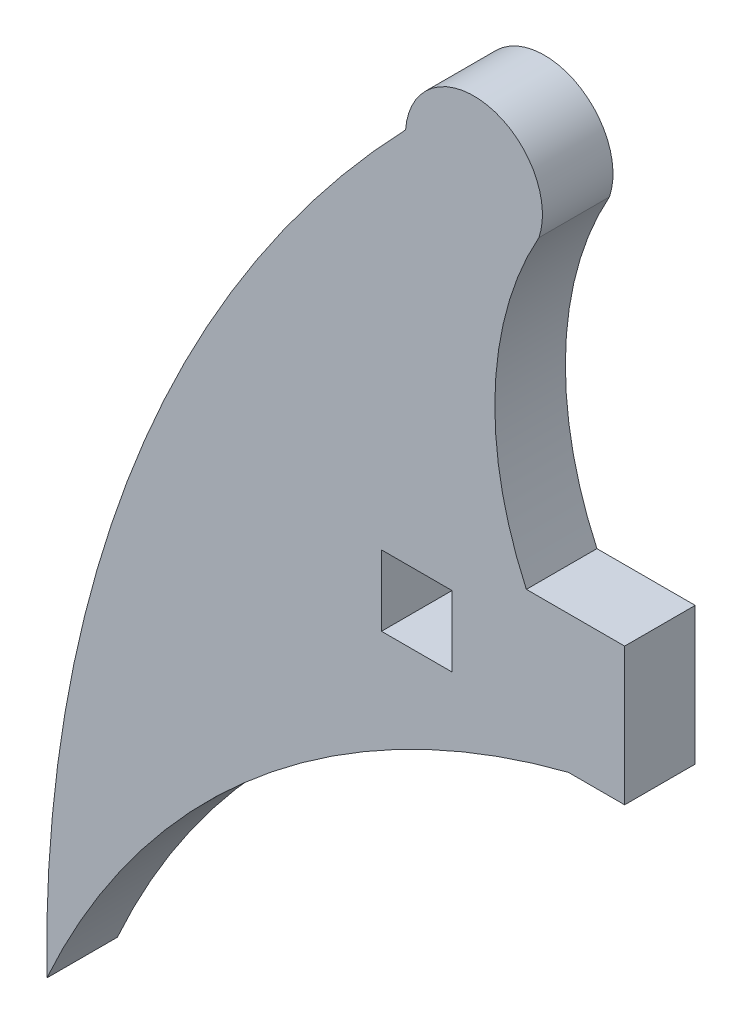
ISO-10303-21;
HEADER;
FILE_DESCRIPTION(('STEP AP214'),'2;1');
FILE_NAME('part.step','',(''),(''),'','','');
FILE_SCHEMA(('AUTOMOTIVE_DESIGN { 1 0 10303 214 1 1 1 1 }'));
ENDSEC;
DATA;
#1=APPLICATION_CONTEXT('core data for automotive mechanical design processes');
#2=APPLICATION_PROTOCOL_DEFINITION('international standard','automotive_design',2000,#1);
#3=PRODUCT_CONTEXT('',#1,'mechanical');
#4=PRODUCT('Part','Part','',(#3));
#5=PRODUCT_RELATED_PRODUCT_CATEGORY('part','',(#4));
#6=PRODUCT_DEFINITION_FORMATION('','',#4);
#7=PRODUCT_DEFINITION_CONTEXT('part definition',#1,'design');
#8=PRODUCT_DEFINITION('design','',#6,#7);
#9=PRODUCT_DEFINITION_SHAPE('','',#8);
#10=(LENGTH_UNIT() NAMED_UNIT(*) SI_UNIT(.MILLI.,.METRE.));
#11=(NAMED_UNIT(*) PLANE_ANGLE_UNIT() SI_UNIT($,.RADIAN.));
#12=(NAMED_UNIT(*) SI_UNIT($,.STERADIAN.) SOLID_ANGLE_UNIT());
#13=UNCERTAINTY_MEASURE_WITH_UNIT(LENGTH_MEASURE(1.E-05),#10,'distance_accuracy_value','');
#14=(GEOMETRIC_REPRESENTATION_CONTEXT(3) GLOBAL_UNCERTAINTY_ASSIGNED_CONTEXT((#13)) GLOBAL_UNIT_ASSIGNED_CONTEXT((#10,
#11,#12)) REPRESENTATION_CONTEXT('',''));
#15=CARTESIAN_POINT('',(0.,0.,0.));
#16=DIRECTION('',(0.,0.,1.));
#17=DIRECTION('',(1.,0.,0.));
#18=AXIS2_PLACEMENT_3D('',#15,#16,#17);
#19=CARTESIAN_POINT('',(-19.266087906411,-18.543187160067,1.524));
#20=DIRECTION('',(0.,0.,1.));
#21=DIRECTION('',(1.,0.,0.));
#22=AXIS2_PLACEMENT_3D('',#19,#20,#21);
#23=PLANE('',#22);
#24=DIRECTION('',(0.,1.,0.));
#25=VECTOR('',#24,1.);
#26=CARTESIAN_POINT('',(-22.225726205393,0.825499999999996,1.524));
#27=LINE('',#26,#25);
#28=CARTESIAN_POINT('',(-22.225726205393,-2.14505283981024,1.524));
#29=VERTEX_POINT('',#28);
#30=CARTESIAN_POINT('',(-22.225726205393,0.825499999999996,1.524));
#31=VERTEX_POINT('',#30);
#32=EDGE_CURVE('E151',#29,#31,#27,.T.);
#33=ORIENTED_EDGE('',*,*,#32,.T.);
#34=DIRECTION('',(-1.,0.,0.));
#35=VECTOR('',#34,1.);
#36=CARTESIAN_POINT('',(-24.3487320911912,0.825499999999996,1.524));
#37=LINE('',#36,#35);
#38=CARTESIAN_POINT('',(-24.3487320911912,0.825499999999999,1.524));
#39=VERTEX_POINT('',#38);
#40=EDGE_CURVE('E154',#31,#39,#37,.T.);
#41=ORIENTED_EDGE('',*,*,#40,.T.);
#42=CARTESIAN_POINT('',(-17.6689482784493,3.91993582217414,1.524));
#43=DIRECTION('',(0.,0.,-1.));
#44=DIRECTION('',(1.,0.,0.));
#45=AXIS2_PLACEMENT_3D('',#42,#43,#44);
#46=CIRCLE('',#45,7.36172838690231);
#47=CARTESIAN_POINT('',(-24.0780338660228,7.54190583498225,1.524));
#48=VERTEX_POINT('',#47);
#49=EDGE_CURVE('E157',#39,#48,#46,.T.);
#50=ORIENTED_EDGE('',*,*,#49,.T.);
#51=CARTESIAN_POINT('',(-25.4821370278551,8.01067786513667,1.524));
#52=DIRECTION('',(0.,0.,1.));
#53=DIRECTION('',(-1.,0.,0.));
#54=AXIS2_PLACEMENT_3D('',#51,#52,#53);
#55=CIRCLE('',#54,1.48028811564599);
#56=CARTESIAN_POINT('',(-26.958529188836,8.11800489955518,1.524));
#57=VERTEX_POINT('',#56);
#58=EDGE_CURVE('E159',#48,#57,#55,.T.);
#59=ORIENTED_EDGE('',*,*,#58,.T.);
#60=CARTESIAN_POINT('',(-6.89765811356134,-11.1510394794695,1.524));
#61=DIRECTION('',(0.,0.,1.));
#62=DIRECTION('',(-1.,0.,0.));
#63=AXIS2_PLACEMENT_3D('',#60,#61,#62);
#64=CIRCLE('',#63,27.8160856264791);
#65=CARTESIAN_POINT('',(-34.7096802394061,-11.6264812226261,1.524));
#66=VERTEX_POINT('',#65);
#67=EDGE_CURVE('E161',#57,#66,#64,.T.);
#68=ORIENTED_EDGE('',*,*,#67,.T.);
#69=CARTESIAN_POINT('',(-19.266087906411,-18.543187160067,1.524));
#70=DIRECTION('',(0.,0.,-1.));
#71=DIRECTION('',(1.,0.,0.));
#72=AXIS2_PLACEMENT_3D('',#69,#70,#71);
#73=CIRCLE('',#72,16.9217423799316);
#74=CARTESIAN_POINT('',(-23.4429953733764,-2.14505283981024,1.524));
#75=VERTEX_POINT('',#74);
#76=EDGE_CURVE('E163',#66,#75,#73,.T.);
#77=ORIENTED_EDGE('',*,*,#76,.T.);
#78=DIRECTION('',(1.,0.,0.));
#79=VECTOR('',#78,1.);
#80=CARTESIAN_POINT('',(-22.225726205393,-2.14505283981024,1.524));
#81=LINE('',#80,#79);
#82=EDGE_CURVE('E165',#75,#29,#81,.T.);
#83=ORIENTED_EDGE('',*,*,#82,.T.);
#84=EDGE_LOOP('',(#33,#41,#50,#59,#68,#77,#83));
#85=FACE_BOUND('',#84,.T.);
#86=DIRECTION('',(-1.,0.,0.));
#87=VECTOR('',#86,1.);
#88=CARTESIAN_POINT('',(-25.9548189252637,0.,1.524));
#89=LINE('',#88,#87);
#90=CARTESIAN_POINT('',(-25.9548189252637,0.,1.524));
#91=VERTEX_POINT('',#90);
#92=CARTESIAN_POINT('',(-27.4788189252637,0.,1.524));
#93=VERTEX_POINT('',#92);
#94=EDGE_CURVE('E123',#91,#93,#89,.T.);
#95=ORIENTED_EDGE('',*,*,#94,.F.);
#96=DIRECTION('',(0.,1.,0.));
#97=VECTOR('',#96,1.);
#98=CARTESIAN_POINT('',(-25.9548189252637,-1.524,1.524));
#99=LINE('',#98,#97);
#100=CARTESIAN_POINT('',(-25.9548189252637,-1.524,1.524));
#101=VERTEX_POINT('',#100);
#102=EDGE_CURVE('E115',#101,#91,#99,.T.);
#103=ORIENTED_EDGE('',*,*,#102,.F.);
#104=DIRECTION('',(1.,0.,0.));
#105=VECTOR('',#104,1.);
#106=CARTESIAN_POINT('',(-25.9548189252637,-1.524,1.524));
#107=LINE('',#106,#105);
#108=CARTESIAN_POINT('',(-27.4788189252637,-1.524,1.524));
#109=VERTEX_POINT('',#108);
#110=EDGE_CURVE('E137',#109,#101,#107,.T.);
#111=ORIENTED_EDGE('',*,*,#110,.F.);
#112=DIRECTION('',(0.,-1.,0.));
#113=VECTOR('',#112,1.);
#114=CARTESIAN_POINT('',(-27.4788189252637,-1.524,1.524));
#115=LINE('',#114,#113);
#116=EDGE_CURVE('E135',#93,#109,#115,.T.);
#117=ORIENTED_EDGE('',*,*,#116,.F.);
#118=EDGE_LOOP('',(#95,#103,#111,#117));
#119=FACE_BOUND('',#118,.T.);
#120=ADVANCED_FACE('F32',(#85,#119),#23,.T.);
#121=CARTESIAN_POINT('',(-19.266087906411,-18.543187160067,0.));
#122=DIRECTION('',(0.,0.,1.));
#123=DIRECTION('',(1.,0.,0.));
#124=AXIS2_PLACEMENT_3D('',#121,#122,#123);
#125=PLANE('',#124);
#126=DIRECTION('',(-1.,0.,0.));
#127=VECTOR('',#126,1.);
#128=CARTESIAN_POINT('',(-24.3487320911912,0.825499999999996,0.));
#129=LINE('',#128,#127);
#130=CARTESIAN_POINT('',(-22.225726205393,0.825499999999996,0.));
#131=VERTEX_POINT('',#130);
#132=CARTESIAN_POINT('',(-24.3487320911912,0.825499999999999,0.));
#133=VERTEX_POINT('',#132);
#134=EDGE_CURVE('E131',#131,#133,#129,.T.);
#135=ORIENTED_EDGE('',*,*,#134,.F.);
#136=DIRECTION('',(0.,1.,0.));
#137=VECTOR('',#136,1.);
#138=CARTESIAN_POINT('',(-22.225726205393,-1.524,0.));
#139=LINE('',#138,#137);
#140=CARTESIAN_POINT('',(-22.225726205393,-2.14505283981024,0.));
#141=VERTEX_POINT('',#140);
#142=EDGE_CURVE('E155',#141,#131,#139,.T.);
#143=ORIENTED_EDGE('',*,*,#142,.F.);
#144=DIRECTION('',(1.,0.,0.));
#145=VECTOR('',#144,1.);
#146=CARTESIAN_POINT('',(-22.225726205393,-2.14505283981024,0.));
#147=LINE('',#146,#145);
#148=CARTESIAN_POINT('',(-23.4429953733764,-2.14505283981024,0.));
#149=VERTEX_POINT('',#148);
#150=EDGE_CURVE('E178',#149,#141,#147,.T.);
#151=ORIENTED_EDGE('',*,*,#150,.F.);
#152=CARTESIAN_POINT('',(-19.266087906411,-18.543187160067,0.));
#153=DIRECTION('',(0.,0.,-1.));
#154=DIRECTION('',(1.,0.,0.));
#155=AXIS2_PLACEMENT_3D('',#152,#153,#154);
#156=CIRCLE('',#155,16.9217423799316);
#157=CARTESIAN_POINT('',(-34.7096802394061,-11.6264812226261,0.));
#158=VERTEX_POINT('',#157);
#159=EDGE_CURVE('E176',#158,#149,#156,.T.);
#160=ORIENTED_EDGE('',*,*,#159,.F.);
#161=CARTESIAN_POINT('',(-6.89765811356134,-11.1510394794695,0.));
#162=DIRECTION('',(0.,0.,1.));
#163=DIRECTION('',(-1.,0.,0.));
#164=AXIS2_PLACEMENT_3D('',#161,#162,#163);
#165=CIRCLE('',#164,27.8160856264791);
#166=CARTESIAN_POINT('',(-26.958529188836,8.11800489955518,0.));
#167=VERTEX_POINT('',#166);
#168=EDGE_CURVE('E174',#167,#158,#165,.T.);
#169=ORIENTED_EDGE('',*,*,#168,.F.);
#170=CARTESIAN_POINT('',(-25.4821370278551,8.01067786513667,0.));
#171=DIRECTION('',(0.,0.,1.));
#172=DIRECTION('',(-1.,0.,0.));
#173=AXIS2_PLACEMENT_3D('',#170,#171,#172);
#174=CIRCLE('',#173,1.48028811564599);
#175=CARTESIAN_POINT('',(-24.0780338660228,7.54190583498225,0.));
#176=VERTEX_POINT('',#175);
#177=EDGE_CURVE('E172',#176,#167,#174,.T.);
#178=ORIENTED_EDGE('',*,*,#177,.F.);
#179=CARTESIAN_POINT('',(-17.6689482784493,3.91993582217414,0.));
#180=DIRECTION('',(0.,0.,-1.));
#181=DIRECTION('',(1.,0.,0.));
#182=AXIS2_PLACEMENT_3D('',#179,#180,#181);
#183=CIRCLE('',#182,7.36172838690231);
#184=EDGE_CURVE('E170',#133,#176,#183,.T.);
#185=ORIENTED_EDGE('',*,*,#184,.F.);
#186=EDGE_LOOP('',(#135,#143,#151,#160,#169,#178,#185));
#187=FACE_BOUND('',#186,.T.);
#188=DIRECTION('',(0.,1.,0.));
#189=VECTOR('',#188,1.);
#190=CARTESIAN_POINT('',(-25.9548189252637,-1.524,0.));
#191=LINE('',#190,#189);
#192=CARTESIAN_POINT('',(-25.9548189252637,-1.524,0.));
#193=VERTEX_POINT('',#192);
#194=CARTESIAN_POINT('',(-25.9548189252637,0.,0.));
#195=VERTEX_POINT('',#194);
#196=EDGE_CURVE('E55',#193,#195,#191,.T.);
#197=ORIENTED_EDGE('',*,*,#196,.T.);
#198=DIRECTION('',(-1.,0.,0.));
#199=VECTOR('',#198,1.);
#200=CARTESIAN_POINT('',(-25.9548189252637,0.,0.));
#201=LINE('',#200,#199);
#202=CARTESIAN_POINT('',(-27.4788189252637,0.,0.));
#203=VERTEX_POINT('',#202);
#204=EDGE_CURVE('E130',#195,#203,#201,.T.);
#205=ORIENTED_EDGE('',*,*,#204,.T.);
#206=DIRECTION('',(0.,-1.,0.));
#207=VECTOR('',#206,1.);
#208=CARTESIAN_POINT('',(-27.4788189252637,-1.524,0.));
#209=LINE('',#208,#207);
#210=CARTESIAN_POINT('',(-27.4788189252637,-1.524,0.));
#211=VERTEX_POINT('',#210);
#212=EDGE_CURVE('E143',#203,#211,#209,.T.);
#213=ORIENTED_EDGE('',*,*,#212,.T.);
#214=DIRECTION('',(1.,0.,0.));
#215=VECTOR('',#214,1.);
#216=CARTESIAN_POINT('',(-25.9548189252637,-1.524,0.));
#217=LINE('',#216,#215);
#218=EDGE_CURVE('E124',#211,#193,#217,.T.);
#219=ORIENTED_EDGE('',*,*,#218,.T.);
#220=EDGE_LOOP('',(#197,#205,#213,#219));
#221=FACE_BOUND('',#220,.T.);
#222=ADVANCED_FACE('F205',(#187,#221),#125,.F.);
#223=CARTESIAN_POINT('',(-24.3487320911912,0.825499999999996,1.524));
#224=DIRECTION('',(0.,-1.,0.));
#225=DIRECTION('',(0.,0.,-1.));
#226=AXIS2_PLACEMENT_3D('',#223,#224,#225);
#227=PLANE('',#226);
#228=ORIENTED_EDGE('',*,*,#134,.T.);
#229=DIRECTION('',(0.,0.,-1.));
#230=VECTOR('',#229,1.);
#231=CARTESIAN_POINT('',(-24.3487320911912,0.825499999999999,1.524));
#232=LINE('',#231,#230);
#233=EDGE_CURVE('E40',#39,#133,#232,.T.);
#234=ORIENTED_EDGE('',*,*,#233,.F.);
#235=ORIENTED_EDGE('',*,*,#40,.F.);
#236=DIRECTION('',(0.,0.,-1.));
#237=VECTOR('',#236,1.);
#238=CARTESIAN_POINT('',(-22.225726205393,0.825499999999996,1.524));
#239=LINE('',#238,#237);
#240=EDGE_CURVE('E11',#31,#131,#239,.T.);
#241=ORIENTED_EDGE('',*,*,#240,.T.);
#242=EDGE_LOOP('',(#228,#234,#235,#241));
#243=FACE_BOUND('',#242,.T.);
#244=ADVANCED_FACE('F34',(#243),#227,.F.);
#245=CARTESIAN_POINT('',(-17.6689482784493,3.91993582217414,1.524));
#246=DIRECTION('',(0.,0.,-1.));
#247=DIRECTION('',(-1.,0.,0.));
#248=AXIS2_PLACEMENT_3D('',#245,#246,#247);
#249=CYLINDRICAL_SURFACE('',#248,7.36172838690231);
#250=ORIENTED_EDGE('',*,*,#184,.T.);
#251=DIRECTION('',(0.,0.,-1.));
#252=VECTOR('',#251,1.);
#253=CARTESIAN_POINT('',(-24.0780338660228,7.54190583498225,1.524));
#254=LINE('',#253,#252);
#255=EDGE_CURVE('E192',#48,#176,#254,.T.);
#256=ORIENTED_EDGE('',*,*,#255,.F.);
#257=ORIENTED_EDGE('',*,*,#49,.F.);
#258=ORIENTED_EDGE('',*,*,#233,.T.);
#259=EDGE_LOOP('',(#250,#256,#257,#258));
#260=FACE_BOUND('',#259,.T.);
#261=ADVANCED_FACE('F199',(#260),#249,.F.);
#262=CARTESIAN_POINT('',(-25.4821370278551,8.01067786513667,1.524));
#263=DIRECTION('',(0.,0.,-1.));
#264=DIRECTION('',(-1.,0.,0.));
#265=AXIS2_PLACEMENT_3D('',#262,#263,#264);
#266=CYLINDRICAL_SURFACE('',#265,1.48028811564599);
#267=ORIENTED_EDGE('',*,*,#177,.T.);
#268=DIRECTION('',(0.,0.,-1.));
#269=VECTOR('',#268,1.);
#270=CARTESIAN_POINT('',(-26.958529188836,8.11800489955518,1.524));
#271=LINE('',#270,#269);
#272=EDGE_CURVE('E189',#57,#167,#271,.T.);
#273=ORIENTED_EDGE('',*,*,#272,.F.);
#274=ORIENTED_EDGE('',*,*,#58,.F.);
#275=ORIENTED_EDGE('',*,*,#255,.T.);
#276=EDGE_LOOP('',(#267,#273,#274,#275));
#277=FACE_BOUND('',#276,.T.);
#278=ADVANCED_FACE('F212',(#277),#266,.T.);
#279=CARTESIAN_POINT('',(-6.89765811356134,-11.1510394794695,1.524));
#280=DIRECTION('',(0.,0.,-1.));
#281=DIRECTION('',(-1.,0.,0.));
#282=AXIS2_PLACEMENT_3D('',#279,#280,#281);
#283=CYLINDRICAL_SURFACE('',#282,27.8160856264791);
#284=ORIENTED_EDGE('',*,*,#168,.T.);
#285=DIRECTION('',(0.,0.,-1.));
#286=VECTOR('',#285,1.);
#287=CARTESIAN_POINT('',(-34.7096802394061,-11.6264812226261,1.524));
#288=LINE('',#287,#286);
#289=EDGE_CURVE('E186',#66,#158,#288,.T.);
#290=ORIENTED_EDGE('',*,*,#289,.F.);
#291=ORIENTED_EDGE('',*,*,#67,.F.);
#292=ORIENTED_EDGE('',*,*,#272,.T.);
#293=EDGE_LOOP('',(#284,#290,#291,#292));
#294=FACE_BOUND('',#293,.T.);
#295=ADVANCED_FACE('F216',(#294),#283,.T.);
#296=CARTESIAN_POINT('',(-19.266087906411,-18.543187160067,1.524));
#297=DIRECTION('',(0.,0.,-1.));
#298=DIRECTION('',(-1.,0.,0.));
#299=AXIS2_PLACEMENT_3D('',#296,#297,#298);
#300=CYLINDRICAL_SURFACE('',#299,16.9217423799316);
#301=ORIENTED_EDGE('',*,*,#159,.T.);
#302=DIRECTION('',(0.,0.,-1.));
#303=VECTOR('',#302,1.);
#304=CARTESIAN_POINT('',(-23.4429953733764,-2.14505283981024,1.524));
#305=LINE('',#304,#303);
#306=EDGE_CURVE('E183',#75,#149,#305,.T.);
#307=ORIENTED_EDGE('',*,*,#306,.F.);
#308=ORIENTED_EDGE('',*,*,#76,.F.);
#309=ORIENTED_EDGE('',*,*,#289,.T.);
#310=EDGE_LOOP('',(#301,#307,#308,#309));
#311=FACE_BOUND('',#310,.T.);
#312=ADVANCED_FACE('F230',(#311),#300,.F.);
#313=CARTESIAN_POINT('',(-22.225726205393,-2.14505283981024,1.524));
#314=DIRECTION('',(0.,1.,0.));
#315=DIRECTION('',(0.,0.,1.));
#316=AXIS2_PLACEMENT_3D('',#313,#314,#315);
#317=PLANE('',#316);
#318=ORIENTED_EDGE('',*,*,#150,.T.);
#319=DIRECTION('',(0.,0.,-1.));
#320=VECTOR('',#319,1.);
#321=CARTESIAN_POINT('',(-22.225726205393,-2.14505283981024,1.524));
#322=LINE('',#321,#320);
#323=EDGE_CURVE('E168',#29,#141,#322,.T.);
#324=ORIENTED_EDGE('',*,*,#323,.F.);
#325=ORIENTED_EDGE('',*,*,#82,.F.);
#326=ORIENTED_EDGE('',*,*,#306,.T.);
#327=EDGE_LOOP('',(#318,#324,#325,#326));
#328=FACE_BOUND('',#327,.T.);
#329=ADVANCED_FACE('F227',(#328),#317,.F.);
#330=CARTESIAN_POINT('',(-22.225726205393,-1.524,1.524));
#331=DIRECTION('',(-1.,0.,0.));
#332=DIRECTION('',(0.,0.,1.));
#333=AXIS2_PLACEMENT_3D('',#330,#331,#332);
#334=PLANE('',#333);
#335=ORIENTED_EDGE('',*,*,#142,.T.);
#336=ORIENTED_EDGE('',*,*,#240,.F.);
#337=ORIENTED_EDGE('',*,*,#32,.F.);
#338=ORIENTED_EDGE('',*,*,#323,.T.);
#339=EDGE_LOOP('',(#335,#336,#337,#338));
#340=FACE_BOUND('',#339,.T.);
#341=ADVANCED_FACE('F223',(#340),#334,.F.);
#342=CARTESIAN_POINT('',(-25.9548189252637,-1.524,1.524));
#343=DIRECTION('',(-1.,0.,0.));
#344=DIRECTION('',(0.,0.,1.));
#345=AXIS2_PLACEMENT_3D('',#342,#343,#344);
#346=PLANE('',#345);
#347=ORIENTED_EDGE('',*,*,#196,.F.);
#348=DIRECTION('',(0.,0.,-1.));
#349=VECTOR('',#348,1.);
#350=CARTESIAN_POINT('',(-25.9548189252637,-1.524,1.524));
#351=LINE('',#350,#349);
#352=EDGE_CURVE('E119',#101,#193,#351,.T.);
#353=ORIENTED_EDGE('',*,*,#352,.F.);
#354=ORIENTED_EDGE('',*,*,#102,.T.);
#355=DIRECTION('',(0.,0.,-1.));
#356=VECTOR('',#355,1.);
#357=CARTESIAN_POINT('',(-25.9548189252637,0.,1.524));
#358=LINE('',#357,#356);
#359=EDGE_CURVE('E118',#91,#195,#358,.T.);
#360=ORIENTED_EDGE('',*,*,#359,.T.);
#361=EDGE_LOOP('',(#347,#353,#354,#360));
#362=FACE_BOUND('',#361,.T.);
#363=ADVANCED_FACE('F117',(#362),#346,.T.);
#364=CARTESIAN_POINT('',(-25.9548189252637,0.,1.524));
#365=DIRECTION('',(0.,-1.,0.));
#366=DIRECTION('',(0.,0.,-1.));
#367=AXIS2_PLACEMENT_3D('',#364,#365,#366);
#368=PLANE('',#367);
#369=ORIENTED_EDGE('',*,*,#204,.F.);
#370=ORIENTED_EDGE('',*,*,#359,.F.);
#371=ORIENTED_EDGE('',*,*,#94,.T.);
#372=DIRECTION('',(0.,0.,-1.));
#373=VECTOR('',#372,1.);
#374=CARTESIAN_POINT('',(-27.4788189252637,0.,1.524));
#375=LINE('',#374,#373);
#376=EDGE_CURVE('E132',#93,#203,#375,.T.);
#377=ORIENTED_EDGE('',*,*,#376,.T.);
#378=EDGE_LOOP('',(#369,#370,#371,#377));
#379=FACE_BOUND('',#378,.T.);
#380=ADVANCED_FACE('F127',(#379),#368,.T.);
#381=CARTESIAN_POINT('',(-27.4788189252637,-1.524,1.524));
#382=DIRECTION('',(1.,0.,0.));
#383=DIRECTION('',(0.,0.,-1.));
#384=AXIS2_PLACEMENT_3D('',#381,#382,#383);
#385=PLANE('',#384);
#386=ORIENTED_EDGE('',*,*,#212,.F.);
#387=ORIENTED_EDGE('',*,*,#376,.F.);
#388=ORIENTED_EDGE('',*,*,#116,.T.);
#389=DIRECTION('',(0.,0.,-1.));
#390=VECTOR('',#389,1.);
#391=CARTESIAN_POINT('',(-27.4788189252637,-1.524,1.524));
#392=LINE('',#391,#390);
#393=EDGE_CURVE('E47',#109,#211,#392,.T.);
#394=ORIENTED_EDGE('',*,*,#393,.T.);
#395=EDGE_LOOP('',(#386,#387,#388,#394));
#396=FACE_BOUND('',#395,.T.);
#397=ADVANCED_FACE('F255',(#396),#385,.T.);
#398=CARTESIAN_POINT('',(-25.9548189252637,-1.524,1.524));
#399=DIRECTION('',(0.,1.,0.));
#400=DIRECTION('',(0.,0.,1.));
#401=AXIS2_PLACEMENT_3D('',#398,#399,#400);
#402=PLANE('',#401);
#403=ORIENTED_EDGE('',*,*,#218,.F.);
#404=ORIENTED_EDGE('',*,*,#393,.F.);
#405=ORIENTED_EDGE('',*,*,#110,.T.);
#406=ORIENTED_EDGE('',*,*,#352,.T.);
#407=EDGE_LOOP('',(#403,#404,#405,#406));
#408=FACE_BOUND('',#407,.T.);
#409=ADVANCED_FACE('F259',(#408),#402,.T.);
#410=CLOSED_SHELL('',(#120,#222,#244,#261,#278,#295,#312,#329,#341,#363,#380,#397,#409));
#411=MANIFOLD_SOLID_BREP('B2',#410);
#412=ADVANCED_BREP_SHAPE_REPRESENTATION('',(#18,#411),#14);
#413=SHAPE_DEFINITION_REPRESENTATION(#9,#412);
ENDSEC;
END-ISO-10303-21;
